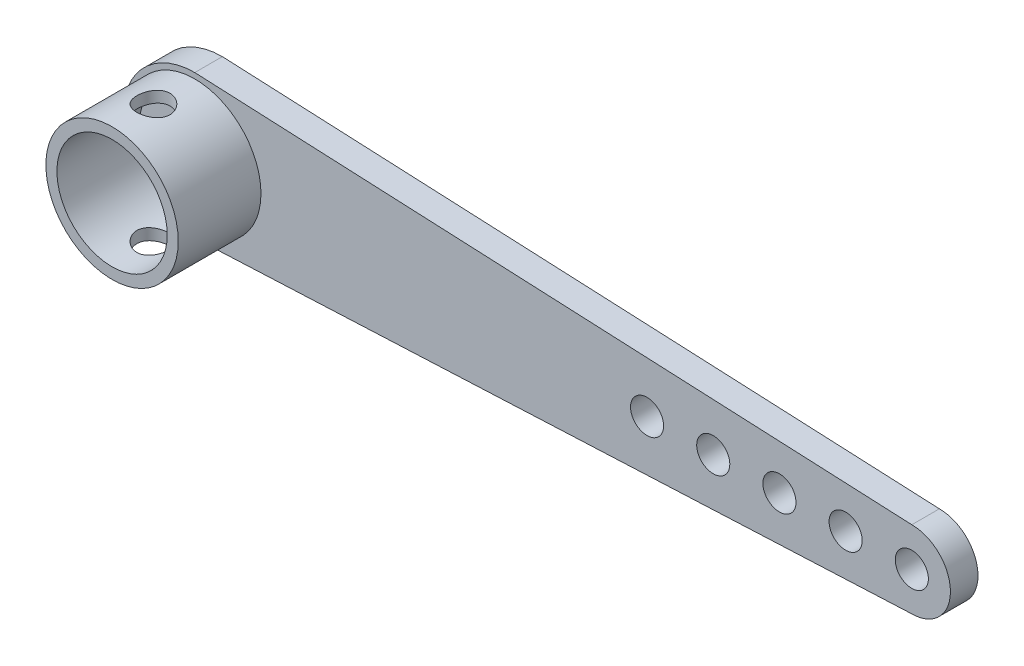
ISO-10303-21;
HEADER;
FILE_DESCRIPTION(('STEP AP214'),'2;1');
FILE_NAME('part.step','',(''),(''),'','','');
FILE_SCHEMA(('AUTOMOTIVE_DESIGN { 1 0 10303 214 1 1 1 1 }'));
ENDSEC;
DATA;
#1=APPLICATION_CONTEXT('core data for automotive mechanical design processes');
#2=APPLICATION_PROTOCOL_DEFINITION('international standard','automotive_design',2000,#1);
#3=PRODUCT_CONTEXT('',#1,'mechanical');
#4=PRODUCT('Part','Part','',(#3));
#5=PRODUCT_RELATED_PRODUCT_CATEGORY('part','',(#4));
#6=PRODUCT_DEFINITION_FORMATION('','',#4);
#7=PRODUCT_DEFINITION_CONTEXT('part definition',#1,'design');
#8=PRODUCT_DEFINITION('design','',#6,#7);
#9=PRODUCT_DEFINITION_SHAPE('','',#8);
#10=(LENGTH_UNIT() NAMED_UNIT(*) SI_UNIT(.MILLI.,.METRE.));
#11=(NAMED_UNIT(*) PLANE_ANGLE_UNIT() SI_UNIT($,.RADIAN.));
#12=(NAMED_UNIT(*) SI_UNIT($,.STERADIAN.) SOLID_ANGLE_UNIT());
#13=UNCERTAINTY_MEASURE_WITH_UNIT(LENGTH_MEASURE(1.E-05),#10,'distance_accuracy_value','');
#14=(GEOMETRIC_REPRESENTATION_CONTEXT(3) GLOBAL_UNCERTAINTY_ASSIGNED_CONTEXT((#13)) GLOBAL_UNIT_ASSIGNED_CONTEXT((#10,
#11,#12)) REPRESENTATION_CONTEXT('',''));
#15=CARTESIAN_POINT('',(0.,0.,0.));
#16=DIRECTION('',(0.,0.,1.));
#17=DIRECTION('',(1.,0.,0.));
#18=AXIS2_PLACEMENT_3D('',#15,#16,#17);
#19=CARTESIAN_POINT('',(0.598724610297591,-12.9723665564478,5.));
#20=DIRECTION('',(-0.0461047666084009,0.998936609848685,0.));
#21=DIRECTION('',(-0.998936609848685,-0.0461047666084009,0.));
#22=AXIS2_PLACEMENT_3D('',#19,#20,#21);
#23=PLANE('',#22);
#24=DIRECTION('',(0.998936609848685,0.0461047666084009,0.));
#25=VECTOR('',#24,1.);
#26=CARTESIAN_POINT('',(0.598724610297591,-12.9723665564478,0.));
#27=LINE('',#26,#25);
#28=CARTESIAN_POINT('',(0.,-13.,0.));
#29=VERTEX_POINT('',#28);
#30=CARTESIAN_POINT('',(130.,-7.,0.));
#31=VERTEX_POINT('',#30);
#32=EDGE_CURVE('E104',#29,#31,#27,.T.);
#33=ORIENTED_EDGE('',*,*,#32,.T.);
#34=DIRECTION('',(0.,0.,-1.));
#35=VECTOR('',#34,1.);
#36=CARTESIAN_POINT('',(130.,-7.,5.));
#37=LINE('',#36,#35);
#38=CARTESIAN_POINT('',(130.,-7.,5.));
#39=VERTEX_POINT('',#38);
#40=EDGE_CURVE('E11',#39,#31,#37,.T.);
#41=ORIENTED_EDGE('',*,*,#40,.F.);
#42=DIRECTION('',(0.998936609848685,0.0461047666084009,0.));
#43=VECTOR('',#42,1.);
#44=CARTESIAN_POINT('',(0.598724610297591,-12.9723665564478,5.));
#45=LINE('',#44,#43);
#46=CARTESIAN_POINT('',(0.,-13.,5.));
#47=VERTEX_POINT('',#46);
#48=EDGE_CURVE('E88',#47,#39,#45,.T.);
#49=ORIENTED_EDGE('',*,*,#48,.F.);
#50=DIRECTION('',(0.,0.,-1.));
#51=VECTOR('',#50,1.);
#52=CARTESIAN_POINT('',(0.,-13.,5.));
#53=LINE('',#52,#51);
#54=EDGE_CURVE('E100',#47,#29,#53,.T.);
#55=ORIENTED_EDGE('',*,*,#54,.T.);
#56=EDGE_LOOP('',(#33,#41,#49,#55));
#57=FACE_BOUND('',#56,.T.);
#58=ADVANCED_FACE('F39',(#57),#23,.F.);
#59=CARTESIAN_POINT('',(130.,0.,5.));
#60=DIRECTION('',(0.,0.,-1.));
#61=DIRECTION('',(-1.,0.,0.));
#62=AXIS2_PLACEMENT_3D('',#59,#60,#61);
#63=CYLINDRICAL_SURFACE('',#62,7.00000000000001);
#64=CARTESIAN_POINT('',(130.,0.,0.));
#65=DIRECTION('',(0.,0.,1.));
#66=DIRECTION('',(1.,0.,0.));
#67=AXIS2_PLACEMENT_3D('',#64,#65,#66);
#68=CIRCLE('',#67,7.00000000000001);
#69=CARTESIAN_POINT('',(130.,7.00000000000001,0.));
#70=VERTEX_POINT('',#69);
#71=EDGE_CURVE('E93',#31,#70,#68,.T.);
#72=ORIENTED_EDGE('',*,*,#71,.T.);
#73=DIRECTION('',(0.,0.,-1.));
#74=VECTOR('',#73,1.);
#75=CARTESIAN_POINT('',(130.,7.00000000000001,5.));
#76=LINE('',#75,#74);
#77=CARTESIAN_POINT('',(130.,7.00000000000001,5.));
#78=VERTEX_POINT('',#77);
#79=EDGE_CURVE('E48',#78,#70,#76,.T.);
#80=ORIENTED_EDGE('',*,*,#79,.F.);
#81=CARTESIAN_POINT('',(130.,0.,5.));
#82=DIRECTION('',(0.,0.,1.));
#83=DIRECTION('',(1.,0.,0.));
#84=AXIS2_PLACEMENT_3D('',#81,#82,#83);
#85=CIRCLE('',#84,7.00000000000001);
#86=EDGE_CURVE('E83',#39,#78,#85,.T.);
#87=ORIENTED_EDGE('',*,*,#86,.F.);
#88=ORIENTED_EDGE('',*,*,#40,.T.);
#89=EDGE_LOOP('',(#72,#80,#87,#88));
#90=FACE_BOUND('',#89,.T.);
#91=ADVANCED_FACE('F92',(#90),#63,.T.);
#92=CARTESIAN_POINT('',(0.598724610297591,12.9723665564478,5.));
#93=DIRECTION('',(0.0461047666084009,0.998936609848685,0.));
#94=DIRECTION('',(-0.998936609848685,0.0461047666084009,0.));
#95=AXIS2_PLACEMENT_3D('',#92,#93,#94);
#96=PLANE('',#95);
#97=DIRECTION('',(0.998936609848685,-0.0461047666084009,0.));
#98=VECTOR('',#97,1.);
#99=CARTESIAN_POINT('',(0.598724610297591,12.9723665564478,0.));
#100=LINE('',#99,#98);
#101=CARTESIAN_POINT('',(0.,13.,0.));
#102=VERTEX_POINT('',#101);
#103=EDGE_CURVE('E109',#102,#70,#100,.T.);
#104=ORIENTED_EDGE('',*,*,#103,.F.);
#105=DIRECTION('',(0.,0.,-1.));
#106=VECTOR('',#105,1.);
#107=CARTESIAN_POINT('',(0.,13.,5.));
#108=LINE('',#107,#106);
#109=CARTESIAN_POINT('',(0.,13.,5.));
#110=VERTEX_POINT('',#109);
#111=EDGE_CURVE('E73',#110,#102,#108,.T.);
#112=ORIENTED_EDGE('',*,*,#111,.F.);
#113=DIRECTION('',(0.998936609848685,-0.0461047666084009,0.));
#114=VECTOR('',#113,1.);
#115=CARTESIAN_POINT('',(0.598724610297591,12.9723665564478,5.));
#116=LINE('',#115,#114);
#117=EDGE_CURVE('E86',#110,#78,#116,.T.);
#118=ORIENTED_EDGE('',*,*,#117,.T.);
#119=ORIENTED_EDGE('',*,*,#79,.T.);
#120=EDGE_LOOP('',(#104,#112,#118,#119));
#121=FACE_BOUND('',#120,.T.);
#122=ADVANCED_FACE('F98',(#121),#96,.T.);
#123=CARTESIAN_POINT('',(0.,0.,5.));
#124=DIRECTION('',(0.,0.,-1.));
#125=DIRECTION('',(-1.,0.,0.));
#126=AXIS2_PLACEMENT_3D('',#123,#124,#125);
#127=CYLINDRICAL_SURFACE('',#126,13.);
#128=CARTESIAN_POINT('',(0.,0.,0.));
#129=DIRECTION('',(0.,0.,1.));
#130=DIRECTION('',(1.,0.,0.));
#131=AXIS2_PLACEMENT_3D('',#128,#129,#130);
#132=CIRCLE('',#131,13.);
#133=EDGE_CURVE('E76',#102,#29,#132,.T.);
#134=ORIENTED_EDGE('',*,*,#133,.T.);
#135=ORIENTED_EDGE('',*,*,#54,.F.);
#136=CARTESIAN_POINT('',(0.,0.,5.));
#137=DIRECTION('',(0.,0.,1.));
#138=DIRECTION('',(1.,0.,0.));
#139=AXIS2_PLACEMENT_3D('',#136,#137,#138);
#140=CIRCLE('',#139,13.);
#141=EDGE_CURVE('E57',#110,#47,#140,.T.);
#142=ORIENTED_EDGE('',*,*,#141,.F.);
#143=ORIENTED_EDGE('',*,*,#111,.T.);
#144=EDGE_LOOP('',(#134,#135,#142,#143));
#145=FACE_BOUND('',#144,.T.);
#146=ADVANCED_FACE('F169',(#145),#127,.T.);
#147=CARTESIAN_POINT('',(0.,0.,5.));
#148=DIRECTION('',(0.,0.,1.));
#149=DIRECTION('',(1.,0.,0.));
#150=AXIS2_PLACEMENT_3D('',#147,#148,#149);
#151=PLANE('',#150);
#152=CARTESIAN_POINT('',(130.,0.,5.));
#153=DIRECTION('',(0.,0.,1.));
#154=DIRECTION('',(1.,0.,0.));
#155=AXIS2_PLACEMENT_3D('',#152,#153,#154);
#156=CIRCLE('',#155,2.99999999999999);
#157=CARTESIAN_POINT('',(133.,0.,5.));
#158=VERTEX_POINT('',#157);
#159=EDGE_CURVE('E344',#158,#158,#156,.T.);
#160=ORIENTED_EDGE('',*,*,#159,.F.);
#161=EDGE_LOOP('',(#160));
#162=FACE_BOUND('',#161,.T.);
#163=CARTESIAN_POINT('',(118.,0.,5.));
#164=DIRECTION('',(0.,0.,1.));
#165=DIRECTION('',(1.,0.,0.));
#166=AXIS2_PLACEMENT_3D('',#163,#164,#165);
#167=CIRCLE('',#166,3.00000000000001);
#168=CARTESIAN_POINT('',(121.,0.,5.));
#169=VERTEX_POINT('',#168);
#170=EDGE_CURVE('E361',#169,#169,#167,.T.);
#171=ORIENTED_EDGE('',*,*,#170,.F.);
#172=EDGE_LOOP('',(#171));
#173=FACE_BOUND('',#172,.T.);
#174=CARTESIAN_POINT('',(106.,0.,5.));
#175=DIRECTION('',(0.,0.,1.));
#176=DIRECTION('',(1.,0.,0.));
#177=AXIS2_PLACEMENT_3D('',#174,#175,#176);
#178=CIRCLE('',#177,3.00000000000001);
#179=CARTESIAN_POINT('',(109.,0.,5.));
#180=VERTEX_POINT('',#179);
#181=EDGE_CURVE('E364',#180,#180,#178,.T.);
#182=ORIENTED_EDGE('',*,*,#181,.F.);
#183=EDGE_LOOP('',(#182));
#184=FACE_BOUND('',#183,.T.);
#185=CARTESIAN_POINT('',(94.,0.,5.));
#186=DIRECTION('',(0.,0.,1.));
#187=DIRECTION('',(1.,0.,0.));
#188=AXIS2_PLACEMENT_3D('',#185,#186,#187);
#189=CIRCLE('',#188,3.00000000000001);
#190=CARTESIAN_POINT('',(97.,0.,5.));
#191=VERTEX_POINT('',#190);
#192=EDGE_CURVE('E368',#191,#191,#189,.T.);
#193=ORIENTED_EDGE('',*,*,#192,.F.);
#194=EDGE_LOOP('',(#193));
#195=FACE_BOUND('',#194,.T.);
#196=CARTESIAN_POINT('',(82.,0.,5.));
#197=DIRECTION('',(0.,0.,1.));
#198=DIRECTION('',(1.,0.,0.));
#199=AXIS2_PLACEMENT_3D('',#196,#197,#198);
#200=CIRCLE('',#199,3.00000000000001);
#201=CARTESIAN_POINT('',(85.,0.,5.));
#202=VERTEX_POINT('',#201);
#203=EDGE_CURVE('E153',#202,#202,#200,.T.);
#204=ORIENTED_EDGE('',*,*,#203,.F.);
#205=EDGE_LOOP('',(#204));
#206=FACE_BOUND('',#205,.T.);
#207=CARTESIAN_POINT('',(0.,0.,5.));
#208=DIRECTION('',(0.,0.,1.));
#209=DIRECTION('',(1.,0.,0.));
#210=AXIS2_PLACEMENT_3D('',#207,#208,#209);
#211=CIRCLE('',#210,12.);
#212=CARTESIAN_POINT('',(12.,0.,5.));
#213=VERTEX_POINT('',#212);
#214=EDGE_CURVE('E187',#213,#213,#211,.T.);
#215=ORIENTED_EDGE('',*,*,#214,.F.);
#216=EDGE_LOOP('',(#215));
#217=FACE_BOUND('',#216,.T.);
#218=ORIENTED_EDGE('',*,*,#48,.T.);
#219=ORIENTED_EDGE('',*,*,#86,.T.);
#220=ORIENTED_EDGE('',*,*,#117,.F.);
#221=ORIENTED_EDGE('',*,*,#141,.T.);
#222=EDGE_LOOP('',(#218,#219,#220,#221));
#223=FACE_BOUND('',#222,.T.);
#224=ADVANCED_FACE('F84',(#162,#173,#184,#195,#206,#217,#223),#151,.T.);
#225=CARTESIAN_POINT('',(0.,0.,0.));
#226=DIRECTION('',(0.,0.,1.));
#227=DIRECTION('',(1.,0.,0.));
#228=AXIS2_PLACEMENT_3D('',#225,#226,#227);
#229=PLANE('',#228);
#230=CARTESIAN_POINT('',(130.,0.,0.));
#231=DIRECTION('',(0.,0.,1.));
#232=DIRECTION('',(1.,0.,0.));
#233=AXIS2_PLACEMENT_3D('',#230,#231,#232);
#234=CIRCLE('',#233,2.99999999999999);
#235=CARTESIAN_POINT('',(133.,0.,0.));
#236=VERTEX_POINT('',#235);
#237=EDGE_CURVE('E42',#236,#236,#234,.T.);
#238=ORIENTED_EDGE('',*,*,#237,.T.);
#239=EDGE_LOOP('',(#238));
#240=FACE_BOUND('',#239,.T.);
#241=CARTESIAN_POINT('',(118.,0.,0.));
#242=DIRECTION('',(0.,0.,1.));
#243=DIRECTION('',(1.,0.,0.));
#244=AXIS2_PLACEMENT_3D('',#241,#242,#243);
#245=CIRCLE('',#244,3.00000000000001);
#246=CARTESIAN_POINT('',(121.,0.,0.));
#247=VERTEX_POINT('',#246);
#248=EDGE_CURVE('E347',#247,#247,#245,.T.);
#249=ORIENTED_EDGE('',*,*,#248,.T.);
#250=EDGE_LOOP('',(#249));
#251=FACE_BOUND('',#250,.T.);
#252=CARTESIAN_POINT('',(106.,0.,0.));
#253=DIRECTION('',(0.,0.,1.));
#254=DIRECTION('',(1.,0.,0.));
#255=AXIS2_PLACEMENT_3D('',#252,#253,#254);
#256=CIRCLE('',#255,3.00000000000001);
#257=CARTESIAN_POINT('',(109.,0.,0.));
#258=VERTEX_POINT('',#257);
#259=EDGE_CURVE('E349',#258,#258,#256,.T.);
#260=ORIENTED_EDGE('',*,*,#259,.T.);
#261=EDGE_LOOP('',(#260));
#262=FACE_BOUND('',#261,.T.);
#263=CARTESIAN_POINT('',(94.,0.,0.));
#264=DIRECTION('',(0.,0.,1.));
#265=DIRECTION('',(1.,0.,0.));
#266=AXIS2_PLACEMENT_3D('',#263,#264,#265);
#267=CIRCLE('',#266,3.00000000000001);
#268=CARTESIAN_POINT('',(97.,0.,0.));
#269=VERTEX_POINT('',#268);
#270=EDGE_CURVE('E353',#269,#269,#267,.T.);
#271=ORIENTED_EDGE('',*,*,#270,.T.);
#272=EDGE_LOOP('',(#271));
#273=FACE_BOUND('',#272,.T.);
#274=CARTESIAN_POINT('',(82.,0.,0.));
#275=DIRECTION('',(0.,0.,1.));
#276=DIRECTION('',(1.,0.,0.));
#277=AXIS2_PLACEMENT_3D('',#274,#275,#276);
#278=CIRCLE('',#277,3.00000000000001);
#279=CARTESIAN_POINT('',(85.,0.,0.));
#280=VERTEX_POINT('',#279);
#281=EDGE_CURVE('E357',#280,#280,#278,.T.);
#282=ORIENTED_EDGE('',*,*,#281,.T.);
#283=EDGE_LOOP('',(#282));
#284=FACE_BOUND('',#283,.T.);
#285=ORIENTED_EDGE('',*,*,#32,.F.);
#286=ORIENTED_EDGE('',*,*,#133,.F.);
#287=ORIENTED_EDGE('',*,*,#103,.T.);
#288=ORIENTED_EDGE('',*,*,#71,.F.);
#289=EDGE_LOOP('',(#285,#286,#287,#288));
#290=FACE_BOUND('',#289,.T.);
#291=ADVANCED_FACE('F164',(#240,#251,#262,#273,#284,#290),#229,.F.);
#292=CARTESIAN_POINT('',(0.,0.,20.));
#293=DIRECTION('',(0.,0.,-1.));
#294=DIRECTION('',(-1.,0.,0.));
#295=AXIS2_PLACEMENT_3D('',#292,#293,#294);
#296=CYLINDRICAL_SURFACE('',#295,12.);
#297=CARTESIAN_POINT('',(0.,-12.,15.5));
#298=CARTESIAN_POINT('',(0.165752177339462,-11.9999971973602,15.4999953485237));
#299=CARTESIAN_POINT('',(0.331556315661526,-11.9965315626365,15.4862168984524));
#300=CARTESIAN_POINT('',(0.658412647541065,-11.9830422765979,15.431549697386));
#301=CARTESIAN_POINT('',(0.819462093741479,-11.9730149083995,15.3906455809243));
#302=CARTESIAN_POINT('',(1.13204174436515,-11.9475125266406,15.2831214930758));
#303=CARTESIAN_POINT('',(1.28358312686,-11.9320440568412,15.2165324025695));
#304=CARTESIAN_POINT('',(1.57334426380886,-11.8973068761524,15.0596372199103));
#305=CARTESIAN_POINT('',(1.71156356869753,-11.8780380370831,14.9693303277621));
#306=CARTESIAN_POINT('',(1.97360385460183,-11.8373482718339,14.7655984206916));
#307=CARTESIAN_POINT('',(2.09711138012211,-11.8158941429625,14.6517768500819));
#308=CARTESIAN_POINT('',(2.32349785440664,-11.7734724023587,14.4050955901819));
#309=CARTESIAN_POINT('',(2.42637447389838,-11.7525048457974,14.2722337541061));
#310=CARTESIAN_POINT('',(2.61005308559795,-11.7130955139634,13.988809546526));
#311=CARTESIAN_POINT('',(2.69050443185028,-11.6946958892962,13.8380135383825));
#312=CARTESIAN_POINT('',(2.82479381710149,-11.6629898963603,13.5245031766799));
#313=CARTESIAN_POINT('',(2.87863611088028,-11.6496827138884,13.361790733336));
#314=CARTESIAN_POINT('',(2.95710967360953,-11.6300095339265,13.0325130035967));
#315=CARTESIAN_POINT('',(2.98230453666411,-11.6235098199402,12.866090207924));
#316=CARTESIAN_POINT('',(3.00452355013282,-11.6177872491918,12.5312628620013));
#317=CARTESIAN_POINT('',(3.00155228363622,-11.6185632085586,12.3628586386157));
#318=CARTESIAN_POINT('',(2.96797304927941,-11.6271841103363,12.0331683845093));
#319=CARTESIAN_POINT('',(2.93803668038127,-11.6348572601459,11.8718087570693));
#320=CARTESIAN_POINT('',(2.85244837380599,-11.6561341934214,11.5564778981779));
#321=CARTESIAN_POINT('',(2.79679460413879,-11.6697383993848,11.4025071939422));
#322=CARTESIAN_POINT('',(2.66077895587437,-11.7015022781132,11.1045239674957));
#323=CARTESIAN_POINT('',(2.58017333446584,-11.7197065493963,10.9606276564209));
#324=CARTESIAN_POINT('',(2.39671255202989,-11.7585942169198,10.6881625804864));
#325=CARTESIAN_POINT('',(2.29385349761767,-11.7792780466926,10.5595965038655));
#326=CARTESIAN_POINT('',(2.06532684936244,-11.8215176107978,10.3175927686112));
#327=CARTESIAN_POINT('',(1.93909251633172,-11.84308138956,10.2046910198773));
#328=CARTESIAN_POINT('',(1.6692238350074,-11.8841193115751,10.0015575150722));
#329=CARTESIAN_POINT('',(1.52558895541589,-11.9035933909882,9.91132645147287));
#330=CARTESIAN_POINT('',(1.22423177736278,-11.9383546418838,9.75589882755123));
#331=CARTESIAN_POINT('',(1.06646278641725,-11.9536272025545,9.69078931949114));
#332=CARTESIAN_POINT('',(0.741752016285765,-11.9781583398283,9.58816538858085));
#333=CARTESIAN_POINT('',(0.574811998300968,-11.9874180667856,9.55064568716372));
#334=CARTESIAN_POINT('',(0.241079940780053,-11.9987099854275,9.50508486888232));
#335=CARTESIAN_POINT('',(0.0743934399764201,-12.0009210701655,9.4963139478494));
#336=CARTESIAN_POINT('',(-0.258065749603017,-11.998376096289,9.50649800411098));
#337=CARTESIAN_POINT('',(-0.423838519289193,-11.9936206648371,9.52545048559827));
#338=CARTESIAN_POINT('',(-0.747228537552981,-11.977791622547,9.58994181678275));
#339=CARTESIAN_POINT('',(-0.9049302379375,-11.9668126837158,9.63508252695395));
#340=CARTESIAN_POINT('',(-1.21051458490503,-11.9397741326831,9.75021416805692));
#341=CARTESIAN_POINT('',(-1.3583962380653,-11.9237140073996,9.82020760862644));
#342=CARTESIAN_POINT('',(-1.64304626885966,-11.8878661585244,9.98447225774935));
#343=CARTESIAN_POINT('',(-1.77957088367153,-11.868017347332,10.0791522247931));
#344=CARTESIAN_POINT('',(-2.03505322728662,-11.826890183755,10.2895798175943));
#345=CARTESIAN_POINT('',(-2.1540079179465,-11.8056115850589,10.4053310792353));
#346=CARTESIAN_POINT('',(-2.37398113614497,-11.76337913919,10.6580039216874));
#347=CARTESIAN_POINT('',(-2.47448773524221,-11.7424460836496,10.7953754059991));
#348=CARTESIAN_POINT('',(-2.65102151802725,-11.7038575676408,11.0854652689372));
#349=CARTESIAN_POINT('',(-2.72704978832281,-11.6862019616993,11.2381829659409));
#350=CARTESIAN_POINT('',(-2.85190284121468,-11.656361894336,11.5538114448125));
#351=CARTESIAN_POINT('',(-2.90088879328717,-11.6441451045097,11.7166552566246));
#352=CARTESIAN_POINT('',(-2.97069131988587,-11.626534880479,12.0486192757106));
#353=CARTESIAN_POINT('',(-2.99151405495183,-11.6211399540485,12.2177381020429));
#354=CARTESIAN_POINT('',(-3.004077180673,-11.6178980244194,12.5522420477232));
#355=CARTESIAN_POINT('',(-2.99663579556158,-11.6198386546564,12.7175948702529));
#356=CARTESIAN_POINT('',(-2.95475455662439,-11.6305581800657,13.0446077773325));
#357=CARTESIAN_POINT('',(-2.92031524537318,-11.6393369378128,13.2062679360264));
#358=CARTESIAN_POINT('',(-2.82586263888595,-11.6626252136787,13.5204169181317));
#359=CARTESIAN_POINT('',(-2.76600280936085,-11.6771003047327,13.6729546104807));
#360=CARTESIAN_POINT('',(-2.62252982721005,-11.7101551144901,13.9659307654271));
#361=CARTESIAN_POINT('',(-2.53891338006835,-11.7287354024137,14.1063675463738));
#362=CARTESIAN_POINT('',(-2.3477354972743,-11.7685126852721,14.3751092580041));
#363=CARTESIAN_POINT('',(-2.23960632582452,-11.7897652966356,14.5030021468479));
#364=CARTESIAN_POINT('',(-2.00357874237946,-11.8321605449252,14.7390940895908));
#365=CARTESIAN_POINT('',(-1.87567564252229,-11.8533031545411,14.8472884602259));
#366=CARTESIAN_POINT('',(-1.60093517340518,-11.8935531129534,15.0428226171292));
#367=CARTESIAN_POINT('',(-1.45379684463277,-11.9126166673174,15.1297492273432));
#368=CARTESIAN_POINT('',(-1.14653211902095,-11.9460984995023,15.2774949258811));
#369=CARTESIAN_POINT('',(-0.986415126873479,-11.9605201039956,15.3383327212971));
#370=CARTESIAN_POINT('',(-0.688820506486943,-11.9809611913108,15.4231436606593));
#371=CARTESIAN_POINT('',(-0.552760341816137,-11.9880517010538,15.4519024861069));
#372=CARTESIAN_POINT('',(-0.277812143072566,-11.997572104639,15.4903318872439));
#373=CARTESIAN_POINT('',(-0.138924322485232,-12.0000023490179,15.5000038986106));
#374=CARTESIAN_POINT('',(0.,-12.,15.5));
#375=B_SPLINE_CURVE_WITH_KNOTS('',3,(#297,#298,#299,#300,#301,#302,#303,#304,#305,#306,#307,
#308,#309,#310,#311,#312,#313,#314,#315,#316,#317,#318,#319,#320,#321,#322,#323,#324,#325,#326,
#327,#328,#329,#330,#331,#332,#333,#334,#335,#336,#337,#338,#339,#340,#341,#342,#343,#344,#345,
#346,#347,#348,#349,#350,#351,#352,#353,#354,#355,#356,#357,#358,#359,#360,#361,#362,#363,#364,
#365,#366,#367,#368,#369,#370,#371,#372,#373,#374),.UNSPECIFIED.,.T.,.F.,(4,2,2,2,2,2,2,2,2,2,2,
2,2,2,2,2,2,2,2,2,2,2,2,2,2,2,2,2,2,2,2,2,2,2,2,2,2,2,4),(0.,0.496747424943779,0.9937764755278,
1.49020980457221,1.98665988033866,2.49228870874278,2.99797459160124,3.51117295091613,
4.02428922338737,4.5271259020214,5.02988076232035,5.52044994020678,6.01105406938718,
6.506610557544,7.00225381678967,7.5120300194468,8.02182179123136,8.5333645802487,
9.04480947383927,9.54316617905194,10.0414780223213,10.5324054903472,11.0233825465122,
11.5230717513735,12.0228472602268,12.5348901841559,13.0469103750566,13.5558450923716,
14.0646684651657,14.5588756080898,15.0530728192382,15.5443280113065,16.0356513628556,
16.5397915283158,17.0440513955259,17.5574437101093,18.0704672765446,18.4868448589605,
18.9031911209784),.UNSPECIFIED.);
#376=CARTESIAN_POINT('',(0.,-12.,15.5));
#377=VERTEX_POINT('',#376);
#378=EDGE_CURVE('E152',#377,#377,#375,.T.);
#379=ORIENTED_EDGE('',*,*,#378,.T.);
#380=EDGE_LOOP('',(#379));
#381=FACE_BOUND('',#380,.T.);
#382=CARTESIAN_POINT('',(0.,12.,15.5));
#383=CARTESIAN_POINT('',(-0.165752177339462,11.9999971973602,15.4999953485237));
#384=CARTESIAN_POINT('',(-0.331556315661526,11.9965315626365,15.4862168984524));
#385=CARTESIAN_POINT('',(-0.658412647541065,11.9830422765979,15.431549697386));
#386=CARTESIAN_POINT('',(-0.819462093741479,11.9730149083995,15.3906455809243));
#387=CARTESIAN_POINT('',(-1.13204174436515,11.9475125266406,15.2831214930758));
#388=CARTESIAN_POINT('',(-1.28358312686,11.9320440568412,15.2165324025695));
#389=CARTESIAN_POINT('',(-1.57334426380886,11.8973068761524,15.0596372199103));
#390=CARTESIAN_POINT('',(-1.71156356869753,11.8780380370831,14.9693303277621));
#391=CARTESIAN_POINT('',(-1.97360385460183,11.8373482718339,14.7655984206916));
#392=CARTESIAN_POINT('',(-2.09711138012211,11.8158941429625,14.6517768500819));
#393=CARTESIAN_POINT('',(-2.32349785440664,11.7734724023587,14.4050955901819));
#394=CARTESIAN_POINT('',(-2.42637447389838,11.7525048457974,14.2722337541061));
#395=CARTESIAN_POINT('',(-2.61005308559795,11.7130955139634,13.988809546526));
#396=CARTESIAN_POINT('',(-2.69050443185028,11.6946958892962,13.8380135383825));
#397=CARTESIAN_POINT('',(-2.82479381710149,11.6629898963603,13.5245031766799));
#398=CARTESIAN_POINT('',(-2.87863611088028,11.6496827138884,13.361790733336));
#399=CARTESIAN_POINT('',(-2.95710967360953,11.6300095339265,13.0325130035967));
#400=CARTESIAN_POINT('',(-2.98230453666411,11.6235098199402,12.866090207924));
#401=CARTESIAN_POINT('',(-3.00452355013282,11.6177872491918,12.5312628620013));
#402=CARTESIAN_POINT('',(-3.00155228363622,11.6185632085586,12.3628586386157));
#403=CARTESIAN_POINT('',(-2.96797304927941,11.6271841103363,12.0331683845093));
#404=CARTESIAN_POINT('',(-2.93803668038127,11.6348572601459,11.8718087570693));
#405=CARTESIAN_POINT('',(-2.85244837380599,11.6561341934214,11.5564778981779));
#406=CARTESIAN_POINT('',(-2.79679460413879,11.6697383993848,11.4025071939422));
#407=CARTESIAN_POINT('',(-2.66077895587437,11.7015022781132,11.1045239674957));
#408=CARTESIAN_POINT('',(-2.58017333446584,11.7197065493963,10.9606276564209));
#409=CARTESIAN_POINT('',(-2.39671255202989,11.7585942169198,10.6881625804864));
#410=CARTESIAN_POINT('',(-2.29385349761767,11.7792780466926,10.5595965038655));
#411=CARTESIAN_POINT('',(-2.06532684936244,11.8215176107978,10.3175927686112));
#412=CARTESIAN_POINT('',(-1.93909251633172,11.84308138956,10.2046910198773));
#413=CARTESIAN_POINT('',(-1.6692238350074,11.8841193115751,10.0015575150722));
#414=CARTESIAN_POINT('',(-1.52558895541589,11.9035933909882,9.91132645147287));
#415=CARTESIAN_POINT('',(-1.22423177736278,11.9383546418838,9.75589882755123));
#416=CARTESIAN_POINT('',(-1.06646278641725,11.9536272025545,9.69078931949114));
#417=CARTESIAN_POINT('',(-0.741752016285765,11.9781583398283,9.58816538858085));
#418=CARTESIAN_POINT('',(-0.574811998300968,11.9874180667856,9.55064568716372));
#419=CARTESIAN_POINT('',(-0.241079940780053,11.9987099854275,9.50508486888232));
#420=CARTESIAN_POINT('',(-0.0743934399764201,12.0009210701655,9.4963139478494));
#421=CARTESIAN_POINT('',(0.258065749603017,11.998376096289,9.50649800411098));
#422=CARTESIAN_POINT('',(0.423838519289193,11.9936206648371,9.52545048559827));
#423=CARTESIAN_POINT('',(0.747228537552981,11.977791622547,9.58994181678275));
#424=CARTESIAN_POINT('',(0.9049302379375,11.9668126837158,9.63508252695395));
#425=CARTESIAN_POINT('',(1.21051458490503,11.9397741326831,9.75021416805692));
#426=CARTESIAN_POINT('',(1.3583962380653,11.9237140073996,9.82020760862644));
#427=CARTESIAN_POINT('',(1.64304626885966,11.8878661585244,9.98447225774935));
#428=CARTESIAN_POINT('',(1.77957088367153,11.868017347332,10.0791522247931));
#429=CARTESIAN_POINT('',(2.03505322728662,11.826890183755,10.2895798175943));
#430=CARTESIAN_POINT('',(2.1540079179465,11.8056115850589,10.4053310792353));
#431=CARTESIAN_POINT('',(2.37398113614497,11.76337913919,10.6580039216874));
#432=CARTESIAN_POINT('',(2.47448773524221,11.7424460836496,10.7953754059991));
#433=CARTESIAN_POINT('',(2.65102151802725,11.7038575676408,11.0854652689372));
#434=CARTESIAN_POINT('',(2.72704978832281,11.6862019616993,11.2381829659409));
#435=CARTESIAN_POINT('',(2.85190284121468,11.656361894336,11.5538114448125));
#436=CARTESIAN_POINT('',(2.90088879328717,11.6441451045097,11.7166552566246));
#437=CARTESIAN_POINT('',(2.97069131988587,11.626534880479,12.0486192757106));
#438=CARTESIAN_POINT('',(2.99151405495183,11.6211399540485,12.2177381020429));
#439=CARTESIAN_POINT('',(3.004077180673,11.6178980244194,12.5522420477232));
#440=CARTESIAN_POINT('',(2.99663579556158,11.6198386546564,12.7175948702529));
#441=CARTESIAN_POINT('',(2.95475455662439,11.6305581800657,13.0446077773325));
#442=CARTESIAN_POINT('',(2.92031524537318,11.6393369378128,13.2062679360264));
#443=CARTESIAN_POINT('',(2.82586263888595,11.6626252136787,13.5204169181317));
#444=CARTESIAN_POINT('',(2.76600280936085,11.6771003047327,13.6729546104807));
#445=CARTESIAN_POINT('',(2.62252982721005,11.7101551144901,13.9659307654271));
#446=CARTESIAN_POINT('',(2.53891338006835,11.7287354024137,14.1063675463738));
#447=CARTESIAN_POINT('',(2.3477354972743,11.7685126852721,14.3751092580041));
#448=CARTESIAN_POINT('',(2.23960632582452,11.7897652966356,14.5030021468479));
#449=CARTESIAN_POINT('',(2.00357874237946,11.8321605449252,14.7390940895908));
#450=CARTESIAN_POINT('',(1.87567564252229,11.8533031545411,14.8472884602259));
#451=CARTESIAN_POINT('',(1.60093517340518,11.8935531129534,15.0428226171292));
#452=CARTESIAN_POINT('',(1.45379684463277,11.9126166673174,15.1297492273432));
#453=CARTESIAN_POINT('',(1.14653211902095,11.9460984995023,15.2774949258811));
#454=CARTESIAN_POINT('',(0.986415126873479,11.9605201039956,15.3383327212971));
#455=CARTESIAN_POINT('',(0.688820506486943,11.9809611913108,15.4231436606593));
#456=CARTESIAN_POINT('',(0.552760341816137,11.9880517010538,15.4519024861069));
#457=CARTESIAN_POINT('',(0.277812143072566,11.997572104639,15.4903318872439));
#458=CARTESIAN_POINT('',(0.138924322485232,12.0000023490179,15.5000038986106));
#459=CARTESIAN_POINT('',(0.,12.,15.5));
#460=B_SPLINE_CURVE_WITH_KNOTS('',3,(#382,#383,#384,#385,#386,#387,#388,#389,#390,#391,#392,
#393,#394,#395,#396,#397,#398,#399,#400,#401,#402,#403,#404,#405,#406,#407,#408,#409,#410,#411,
#412,#413,#414,#415,#416,#417,#418,#419,#420,#421,#422,#423,#424,#425,#426,#427,#428,#429,#430,
#431,#432,#433,#434,#435,#436,#437,#438,#439,#440,#441,#442,#443,#444,#445,#446,#447,#448,#449,
#450,#451,#452,#453,#454,#455,#456,#457,#458,#459),.UNSPECIFIED.,.T.,.F.,(4,2,2,2,2,2,2,2,2,2,2,
2,2,2,2,2,2,2,2,2,2,2,2,2,2,2,2,2,2,2,2,2,2,2,2,2,2,2,4),(0.,0.496747424943779,0.9937764755278,
1.49020980457221,1.98665988033866,2.49228870874278,2.99797459160124,3.51117295091613,
4.02428922338737,4.5271259020214,5.02988076232035,5.52044994020678,6.01105406938718,
6.506610557544,7.00225381678967,7.5120300194468,8.02182179123136,8.5333645802487,
9.04480947383927,9.54316617905194,10.0414780223213,10.5324054903472,11.0233825465122,
11.5230717513735,12.0228472602268,12.5348901841559,13.0469103750566,13.5558450923716,
14.0646684651657,14.5588756080898,15.0530728192382,15.5443280113065,16.0356513628556,
16.5397915283158,17.0440513955259,17.5574437101093,18.0704672765446,18.4868448589605,
18.9031911209784),.UNSPECIFIED.);
#461=CARTESIAN_POINT('',(0.,12.,15.5));
#462=VERTEX_POINT('',#461);
#463=EDGE_CURVE('E145',#462,#462,#460,.T.);
#464=ORIENTED_EDGE('',*,*,#463,.T.);
#465=EDGE_LOOP('',(#464));
#466=FACE_BOUND('',#465,.T.);
#467=CARTESIAN_POINT('',(0.,0.,20.));
#468=DIRECTION('',(0.,0.,1.));
#469=DIRECTION('',(1.,0.,0.));
#470=AXIS2_PLACEMENT_3D('',#467,#468,#469);
#471=CIRCLE('',#470,12.);
#472=CARTESIAN_POINT('',(12.,0.,20.));
#473=VERTEX_POINT('',#472);
#474=EDGE_CURVE('E107',#473,#473,#471,.T.);
#475=ORIENTED_EDGE('',*,*,#474,.F.);
#476=EDGE_LOOP('',(#475));
#477=FACE_BOUND('',#476,.T.);
#478=ORIENTED_EDGE('',*,*,#214,.T.);
#479=EDGE_LOOP('',(#478));
#480=FACE_BOUND('',#479,.T.);
#481=ADVANCED_FACE('F159',(#381,#466,#477,#480),#296,.T.);
#482=CARTESIAN_POINT('',(0.,0.,20.));
#483=DIRECTION('',(0.,0.,1.));
#484=DIRECTION('',(1.,0.,0.));
#485=AXIS2_PLACEMENT_3D('',#482,#483,#484);
#486=PLANE('',#485);
#487=CARTESIAN_POINT('',(0.,0.,20.));
#488=DIRECTION('',(0.,0.,1.));
#489=DIRECTION('',(1.,0.,0.));
#490=AXIS2_PLACEMENT_3D('',#487,#488,#489);
#491=CIRCLE('',#490,10.);
#492=CARTESIAN_POINT('',(10.,0.,20.));
#493=VERTEX_POINT('',#492);
#494=EDGE_CURVE('E193',#493,#493,#491,.T.);
#495=ORIENTED_EDGE('',*,*,#494,.F.);
#496=EDGE_LOOP('',(#495));
#497=FACE_BOUND('',#496,.T.);
#498=ORIENTED_EDGE('',*,*,#474,.T.);
#499=EDGE_LOOP('',(#498));
#500=FACE_BOUND('',#499,.T.);
#501=ADVANCED_FACE('F163',(#497,#500),#486,.T.);
#502=CARTESIAN_POINT('',(0.,0.,5.));
#503=DIRECTION('',(0.,0.,1.));
#504=DIRECTION('',(1.,0.,0.));
#505=AXIS2_PLACEMENT_3D('',#502,#503,#504);
#506=CYLINDRICAL_SURFACE('',#505,10.);
#507=CARTESIAN_POINT('',(0.,-10.,15.5));
#508=CARTESIAN_POINT('',(-0.1645772255066,-9.99999858501101,15.4999980050302));
#509=CARTESIAN_POINT('',(-0.329174636703059,-9.99589831387907,15.4864122727521));
#510=CARTESIAN_POINT('',(-0.653576250609762,-9.97994211187382,15.4325572915558));
#511=CARTESIAN_POINT('',(-0.81337900882284,-9.96808386779384,15.3922800839533));
#512=CARTESIAN_POINT('',(-1.12346541550905,-9.93791105003673,15.2865079661795));
#513=CARTESIAN_POINT('',(-1.27376272879075,-9.91960600500851,15.2210502607621));
#514=CARTESIAN_POINT('',(-1.56124836210626,-9.87844218475291,15.0669278138883));
#515=CARTESIAN_POINT('',(-1.69843493493934,-9.85558280384133,14.9782599852092));
#516=CARTESIAN_POINT('',(-1.95974359436749,-9.80701474385548,14.7775519850547));
#517=CARTESIAN_POINT('',(-2.08343614248868,-9.78124767314073,14.6649667482282));
#518=CARTESIAN_POINT('',(-2.31049841846647,-9.73011668420884,14.4207815401796));
#519=CARTESIAN_POINT('',(-2.41386472654882,-9.70475283449003,14.2891783757501));
#520=CARTESIAN_POINT('',(-2.59960075447415,-9.65668227987544,14.0070584939248));
#521=CARTESIAN_POINT('',(-2.68144618044427,-9.63404813327749,13.8561830780185));
#522=CARTESIAN_POINT('',(-2.81842789549521,-9.59487240788062,13.5420214915394));
#523=CARTESIAN_POINT('',(-2.87357059839947,-9.57832936626621,13.378738312144));
#524=CARTESIAN_POINT('',(-2.95403267365303,-9.55381741676868,13.0492194677391));
#525=CARTESIAN_POINT('',(-2.98014392469355,-9.54562138649067,12.8831945122721));
#526=CARTESIAN_POINT('',(-3.00427461229344,-9.53805579499534,12.5489336875665));
#527=CARTESIAN_POINT('',(-3.00230085522157,-9.53868409521142,12.3806983638818));
#528=CARTESIAN_POINT('',(-2.97093954399623,-9.54849488135555,12.053232182783));
#529=CARTESIAN_POINT('',(-2.9425441052537,-9.55736777198281,11.8938954992755));
#530=CARTESIAN_POINT('',(-2.86074840854112,-9.58216712457248,11.5823604274531));
#531=CARTESIAN_POINT('',(-2.80734568283282,-9.59809428264701,11.4301627452513));
#532=CARTESIAN_POINT('',(-2.67632053307363,-9.63545466149946,11.1347993006785));
#533=CARTESIAN_POINT('',(-2.59837633869285,-9.65696032231904,10.9917858320895));
#534=CARTESIAN_POINT('',(-2.42070445177367,-9.70301974000129,10.7205359559796));
#535=CARTESIAN_POINT('',(-2.32097148005177,-9.72757423493982,10.5923031411724));
#536=CARTESIAN_POINT('',(-2.09762581531093,-9.77822022595875,10.348627618476));
#537=CARTESIAN_POINT('',(-1.97318981493394,-9.80433308620996,10.2339426719407));
#538=CARTESIAN_POINT('',(-1.70652651862793,-9.85424488126517,10.0268920318715));
#539=CARTESIAN_POINT('',(-1.56429810372178,-9.8780436703682,9.93452774317115));
#540=CARTESIAN_POINT('',(-1.26471007668561,-9.92086320138941,9.77428015507054));
#541=CARTESIAN_POINT('',(-1.1072554994959,-9.93985087336628,9.70656496750028));
#542=CARTESIAN_POINT('',(-0.782490831207039,-9.97067043664444,9.59880081980074));
#543=CARTESIAN_POINT('',(-0.615183503179163,-9.98250432373999,9.55874414293502));
#544=CARTESIAN_POINT('',(-0.281904485336663,-9.99736729287077,9.50869564420121));
#545=CARTESIAN_POINT('',(-0.116100195202374,-10.0006970083558,9.49767682839678));
#546=CARTESIAN_POINT('',(0.214999211646766,-9.99905846483519,9.50313831142416));
#547=CARTESIAN_POINT('',(0.380294393381561,-9.99409131355514,9.51961493930289));
#548=CARTESIAN_POINT('',(0.701807210619394,-9.97661393974325,9.57876922222299));
#549=CARTESIAN_POINT('',(0.858145545228339,-9.96427659598829,9.62084677516174));
#550=CARTESIAN_POINT('',(1.16150927790904,-9.9334869568307,9.7292864655564));
#551=CARTESIAN_POINT('',(1.30853355405117,-9.91503392642188,9.79565152207572));
#552=CARTESIAN_POINT('',(1.5928743789221,-9.87339308702631,9.95250633096227));
#553=CARTESIAN_POINT('',(1.72988765239933,-9.8501056165928,10.043518681896));
#554=CARTESIAN_POINT('',(1.9870466159603,-9.80146937528705,10.2464495081056));
#555=CARTESIAN_POINT('',(2.10718806471188,-9.7761200886242,10.3583732237753));
#556=CARTESIAN_POINT('',(2.33171489102052,-9.72506343738007,10.6047746167387));
#557=CARTESIAN_POINT('',(2.43536962463001,-9.69937650065513,10.7399237515437));
#558=CARTESIAN_POINT('',(2.61857990144313,-9.65153030477949,11.0262558780269));
#559=CARTESIAN_POINT('',(2.69813607658965,-9.62937095313121,11.1774384491158));
#560=CARTESIAN_POINT('',(2.83034694254316,-9.5913437922631,11.49106498251));
#561=CARTESIAN_POINT('',(2.88312693874022,-9.57544675673501,11.6534523730757));
#562=CARTESIAN_POINT('',(2.96043461630306,-9.55183188739737,11.9853759378605));
#563=CARTESIAN_POINT('',(2.98497197957849,-9.54411125069387,12.1549096415661));
#564=CARTESIAN_POINT('',(3.0044396896993,-9.53799944941558,12.4887230367768));
#565=CARTESIAN_POINT('',(3.00056110615887,-9.53923294700394,12.6529273020988));
#566=CARTESIAN_POINT('',(2.9661501088861,-9.54998802392188,12.9782282068012));
#567=CARTESIAN_POINT('',(2.93561876249408,-9.55950927135902,13.139324970361));
#568=CARTESIAN_POINT('',(2.84953777608686,-9.58551527389243,13.4518907982634));
#569=CARTESIAN_POINT('',(2.79430351014248,-9.60191209104934,13.6034545747174));
#570=CARTESIAN_POINT('',(2.66063014242147,-9.63980557805265,13.8952848776414));
#571=CARTESIAN_POINT('',(2.58218659925722,-9.6613032238508,14.0355492352832));
#572=CARTESIAN_POINT('',(2.40097527610175,-9.70795352855338,14.3063262330525));
#573=CARTESIAN_POINT('',(2.29742552185996,-9.7332108032858,14.4362975225204));
#574=CARTESIAN_POINT('',(2.07034869259555,-9.78402640899066,14.6774049966162));
#575=CARTESIAN_POINT('',(1.94681643426898,-9.80958481647543,14.7885362789356));
#576=CARTESIAN_POINT('',(1.67893152436652,-9.85901873141573,14.9920468245899));
#577=CARTESIAN_POINT('',(1.53407577158122,-9.88282319531421,15.0837828937109));
#578=CARTESIAN_POINT('',(1.23028274796705,-9.92521360911553,15.2414703398081));
#579=CARTESIAN_POINT('',(1.07135210599791,-9.94380199862114,15.307433776549));
#580=CARTESIAN_POINT('',(0.761515425310563,-9.97204349938619,15.4057905513055));
#581=CARTESIAN_POINT('',(0.611573923908468,-9.9824405476214,15.4410233457665));
#582=CARTESIAN_POINT('',(0.307760390461558,-9.9964188898898,15.4881270504832));
#583=CARTESIAN_POINT('',(0.153889019716279,-10.0000013230948,15.5000018654096));
#584=CARTESIAN_POINT('',(0.,-10.,15.5));
#585=B_SPLINE_CURVE_WITH_KNOTS('',3,(#507,#508,#509,#510,#511,#512,#513,#514,#515,#516,#517,
#518,#519,#520,#521,#522,#523,#524,#525,#526,#527,#528,#529,#530,#531,#532,#533,#534,#535,#536,
#537,#538,#539,#540,#541,#542,#543,#544,#545,#546,#547,#548,#549,#550,#551,#552,#553,#554,#555,
#556,#557,#558,#559,#560,#561,#562,#563,#564,#565,#566,#567,#568,#569,#570,#571,#572,#573,#574,
#575,#576,#577,#578,#579,#580,#581,#582,#583,#584),.UNSPECIFIED.,.T.,.F.,(4,2,2,2,2,2,2,2,2,2,2,
2,2,2,2,2,2,2,2,2,2,2,2,2,2,2,2,2,2,2,2,2,2,2,2,2,2,2,4),(0.,0.493166407225221,
0.986479929691999,1.47906735260175,1.9717203288254,2.47711205896383,2.98258874577266,
3.49942962008218,4.01614629086447,4.51839378713198,5.02051956638179,5.50452033395352,
5.98856887316003,6.47924852894239,6.97004720317111,7.48134208096333,7.99266913062143,
8.50742093763377,9.02202907057615,9.5181761887709,10.0142570710065,10.4991349336465,
10.9840710918746,11.4802261140582,11.9765056400038,12.4908080064564,13.0050968850536,
13.516956299025,14.0286401892057,14.5190031093854,15.0093463933232,15.4936008081456,
15.9779479511533,16.4799385136898,16.9820594980412,17.4988599232246,18.0154182319959,
18.4766338387004,18.9377723390687),.UNSPECIFIED.);
#586=CARTESIAN_POINT('',(0.,-10.,15.5));
#587=VERTEX_POINT('',#586);
#588=EDGE_CURVE('E122',#587,#587,#585,.T.);
#589=ORIENTED_EDGE('',*,*,#588,.T.);
#590=EDGE_LOOP('',(#589));
#591=FACE_BOUND('',#590,.T.);
#592=CARTESIAN_POINT('',(0.,10.,15.5));
#593=CARTESIAN_POINT('',(0.1645772255066,9.99999858501101,15.4999980050302));
#594=CARTESIAN_POINT('',(0.329174636703059,9.99589831387907,15.4864122727521));
#595=CARTESIAN_POINT('',(0.653576250609762,9.97994211187382,15.4325572915558));
#596=CARTESIAN_POINT('',(0.81337900882284,9.96808386779384,15.3922800839533));
#597=CARTESIAN_POINT('',(1.12346541550905,9.93791105003673,15.2865079661795));
#598=CARTESIAN_POINT('',(1.27376272879075,9.91960600500851,15.2210502607621));
#599=CARTESIAN_POINT('',(1.56124836210626,9.87844218475291,15.0669278138883));
#600=CARTESIAN_POINT('',(1.69843493493934,9.85558280384133,14.9782599852092));
#601=CARTESIAN_POINT('',(1.95974359436749,9.80701474385548,14.7775519850547));
#602=CARTESIAN_POINT('',(2.08343614248868,9.78124767314073,14.6649667482282));
#603=CARTESIAN_POINT('',(2.31049841846647,9.73011668420884,14.4207815401796));
#604=CARTESIAN_POINT('',(2.41386472654882,9.70475283449003,14.2891783757501));
#605=CARTESIAN_POINT('',(2.59960075447415,9.65668227987544,14.0070584939248));
#606=CARTESIAN_POINT('',(2.68144618044427,9.63404813327749,13.8561830780185));
#607=CARTESIAN_POINT('',(2.81842789549521,9.59487240788062,13.5420214915394));
#608=CARTESIAN_POINT('',(2.87357059839947,9.57832936626621,13.378738312144));
#609=CARTESIAN_POINT('',(2.95403267365303,9.55381741676868,13.0492194677391));
#610=CARTESIAN_POINT('',(2.98014392469355,9.54562138649067,12.8831945122721));
#611=CARTESIAN_POINT('',(3.00427461229344,9.53805579499534,12.5489336875665));
#612=CARTESIAN_POINT('',(3.00230085522157,9.53868409521142,12.3806983638818));
#613=CARTESIAN_POINT('',(2.97093954399623,9.54849488135555,12.053232182783));
#614=CARTESIAN_POINT('',(2.9425441052537,9.55736777198281,11.8938954992755));
#615=CARTESIAN_POINT('',(2.86074840854112,9.58216712457248,11.5823604274531));
#616=CARTESIAN_POINT('',(2.80734568283282,9.59809428264701,11.4301627452513));
#617=CARTESIAN_POINT('',(2.67632053307363,9.63545466149946,11.1347993006785));
#618=CARTESIAN_POINT('',(2.59837633869285,9.65696032231904,10.9917858320895));
#619=CARTESIAN_POINT('',(2.42070445177367,9.70301974000129,10.7205359559796));
#620=CARTESIAN_POINT('',(2.32097148005177,9.72757423493982,10.5923031411724));
#621=CARTESIAN_POINT('',(2.09762581531093,9.77822022595875,10.348627618476));
#622=CARTESIAN_POINT('',(1.97318981493394,9.80433308620996,10.2339426719407));
#623=CARTESIAN_POINT('',(1.70652651862793,9.85424488126517,10.0268920318715));
#624=CARTESIAN_POINT('',(1.56429810372178,9.8780436703682,9.93452774317115));
#625=CARTESIAN_POINT('',(1.26471007668561,9.92086320138941,9.77428015507054));
#626=CARTESIAN_POINT('',(1.1072554994959,9.93985087336628,9.70656496750028));
#627=CARTESIAN_POINT('',(0.782490831207039,9.97067043664444,9.59880081980074));
#628=CARTESIAN_POINT('',(0.615183503179163,9.98250432373999,9.55874414293502));
#629=CARTESIAN_POINT('',(0.281904485336663,9.99736729287077,9.50869564420121));
#630=CARTESIAN_POINT('',(0.116100195202374,10.0006970083558,9.49767682839678));
#631=CARTESIAN_POINT('',(-0.214999211646766,9.99905846483519,9.50313831142416));
#632=CARTESIAN_POINT('',(-0.380294393381561,9.99409131355514,9.51961493930289));
#633=CARTESIAN_POINT('',(-0.701807210619394,9.97661393974325,9.57876922222299));
#634=CARTESIAN_POINT('',(-0.858145545228339,9.96427659598829,9.62084677516174));
#635=CARTESIAN_POINT('',(-1.16150927790904,9.9334869568307,9.7292864655564));
#636=CARTESIAN_POINT('',(-1.30853355405117,9.91503392642188,9.79565152207572));
#637=CARTESIAN_POINT('',(-1.5928743789221,9.87339308702631,9.95250633096227));
#638=CARTESIAN_POINT('',(-1.72988765239933,9.8501056165928,10.043518681896));
#639=CARTESIAN_POINT('',(-1.9870466159603,9.80146937528705,10.2464495081056));
#640=CARTESIAN_POINT('',(-2.10718806471188,9.7761200886242,10.3583732237753));
#641=CARTESIAN_POINT('',(-2.33171489102052,9.72506343738007,10.6047746167387));
#642=CARTESIAN_POINT('',(-2.43536962463001,9.69937650065513,10.7399237515437));
#643=CARTESIAN_POINT('',(-2.61857990144313,9.65153030477949,11.0262558780269));
#644=CARTESIAN_POINT('',(-2.69813607658965,9.62937095313121,11.1774384491158));
#645=CARTESIAN_POINT('',(-2.83034694254316,9.5913437922631,11.49106498251));
#646=CARTESIAN_POINT('',(-2.88312693874022,9.57544675673501,11.6534523730757));
#647=CARTESIAN_POINT('',(-2.96043461630306,9.55183188739737,11.9853759378605));
#648=CARTESIAN_POINT('',(-2.98497197957849,9.54411125069387,12.1549096415661));
#649=CARTESIAN_POINT('',(-3.0044396896993,9.53799944941558,12.4887230367768));
#650=CARTESIAN_POINT('',(-3.00056110615887,9.53923294700394,12.6529273020988));
#651=CARTESIAN_POINT('',(-2.9661501088861,9.54998802392188,12.9782282068012));
#652=CARTESIAN_POINT('',(-2.93561876249408,9.55950927135902,13.139324970361));
#653=CARTESIAN_POINT('',(-2.84953777608686,9.58551527389243,13.4518907982634));
#654=CARTESIAN_POINT('',(-2.79430351014248,9.60191209104934,13.6034545747174));
#655=CARTESIAN_POINT('',(-2.66063014242147,9.63980557805265,13.8952848776414));
#656=CARTESIAN_POINT('',(-2.58218659925722,9.6613032238508,14.0355492352832));
#657=CARTESIAN_POINT('',(-2.40097527610175,9.70795352855338,14.3063262330525));
#658=CARTESIAN_POINT('',(-2.29742552185996,9.7332108032858,14.4362975225204));
#659=CARTESIAN_POINT('',(-2.07034869259555,9.78402640899066,14.6774049966162));
#660=CARTESIAN_POINT('',(-1.94681643426898,9.80958481647543,14.7885362789356));
#661=CARTESIAN_POINT('',(-1.67893152436652,9.85901873141573,14.9920468245899));
#662=CARTESIAN_POINT('',(-1.53407577158122,9.88282319531421,15.0837828937109));
#663=CARTESIAN_POINT('',(-1.23028274796705,9.92521360911553,15.2414703398081));
#664=CARTESIAN_POINT('',(-1.07135210599791,9.94380199862114,15.307433776549));
#665=CARTESIAN_POINT('',(-0.761515425310563,9.97204349938619,15.4057905513055));
#666=CARTESIAN_POINT('',(-0.611573923908468,9.9824405476214,15.4410233457665));
#667=CARTESIAN_POINT('',(-0.307760390461558,9.9964188898898,15.4881270504832));
#668=CARTESIAN_POINT('',(-0.153889019716279,10.0000013230948,15.5000018654096));
#669=CARTESIAN_POINT('',(0.,10.,15.5));
#670=B_SPLINE_CURVE_WITH_KNOTS('',3,(#592,#593,#594,#595,#596,#597,#598,#599,#600,#601,#602,
#603,#604,#605,#606,#607,#608,#609,#610,#611,#612,#613,#614,#615,#616,#617,#618,#619,#620,#621,
#622,#623,#624,#625,#626,#627,#628,#629,#630,#631,#632,#633,#634,#635,#636,#637,#638,#639,#640,
#641,#642,#643,#644,#645,#646,#647,#648,#649,#650,#651,#652,#653,#654,#655,#656,#657,#658,#659,
#660,#661,#662,#663,#664,#665,#666,#667,#668,#669),.UNSPECIFIED.,.T.,.F.,(4,2,2,2,2,2,2,2,2,2,2,
2,2,2,2,2,2,2,2,2,2,2,2,2,2,2,2,2,2,2,2,2,2,2,2,2,2,2,4),(0.,0.493166407225221,
0.986479929691999,1.47906735260175,1.9717203288254,2.47711205896383,2.98258874577266,
3.49942962008218,4.01614629086447,4.51839378713198,5.02051956638179,5.50452033395352,
5.98856887316003,6.47924852894239,6.97004720317111,7.48134208096333,7.99266913062143,
8.50742093763377,9.02202907057615,9.5181761887709,10.0142570710065,10.4991349336465,
10.9840710918746,11.4802261140582,11.9765056400038,12.4908080064564,13.0050968850536,
13.516956299025,14.0286401892057,14.5190031093854,15.0093463933232,15.4936008081456,
15.9779479511533,16.4799385136898,16.9820594980412,17.4988599232246,18.0154182319959,
18.4766338387004,18.9377723390687),.UNSPECIFIED.);
#671=CARTESIAN_POINT('',(0.,10.,15.5));
#672=VERTEX_POINT('',#671);
#673=EDGE_CURVE('E114',#672,#672,#670,.T.);
#674=ORIENTED_EDGE('',*,*,#673,.T.);
#675=EDGE_LOOP('',(#674));
#676=FACE_BOUND('',#675,.T.);
#677=CARTESIAN_POINT('',(0.,0.,5.));
#678=DIRECTION('',(0.,0.,1.));
#679=DIRECTION('',(1.,0.,0.));
#680=AXIS2_PLACEMENT_3D('',#677,#678,#679);
#681=CIRCLE('',#680,10.);
#682=CARTESIAN_POINT('',(10.,0.,5.));
#683=VERTEX_POINT('',#682);
#684=EDGE_CURVE('E190',#683,#683,#681,.T.);
#685=ORIENTED_EDGE('',*,*,#684,.F.);
#686=EDGE_LOOP('',(#685));
#687=FACE_BOUND('',#686,.T.);
#688=ORIENTED_EDGE('',*,*,#494,.T.);
#689=EDGE_LOOP('',(#688));
#690=FACE_BOUND('',#689,.T.);
#691=ADVANCED_FACE('F127',(#591,#676,#687,#690),#506,.F.);
#692=CARTESIAN_POINT('',(0.,0.,5.));
#693=DIRECTION('',(0.,0.,1.));
#694=DIRECTION('',(1.,0.,0.));
#695=AXIS2_PLACEMENT_3D('',#692,#693,#694);
#696=PLANE('',#695);
#697=ORIENTED_EDGE('',*,*,#684,.T.);
#698=EDGE_LOOP('',(#697));
#699=FACE_BOUND('',#698,.T.);
#700=ADVANCED_FACE('F139',(#699),#696,.T.);
#701=CARTESIAN_POINT('',(0.,-21.5,12.5));
#702=DIRECTION('',(0.,1.,0.));
#703=DIRECTION('',(0.,0.,1.));
#704=AXIS2_PLACEMENT_3D('',#701,#702,#703);
#705=CYLINDRICAL_SURFACE('',#704,3.);
#706=ORIENTED_EDGE('',*,*,#673,.F.);
#707=EDGE_LOOP('',(#706));
#708=FACE_BOUND('',#707,.T.);
#709=ORIENTED_EDGE('',*,*,#463,.F.);
#710=EDGE_LOOP('',(#709));
#711=FACE_BOUND('',#710,.T.);
#712=ADVANCED_FACE('F136',(#708,#711),#705,.F.);
#713=ORIENTED_EDGE('',*,*,#588,.F.);
#714=EDGE_LOOP('',(#713));
#715=FACE_BOUND('',#714,.T.);
#716=ORIENTED_EDGE('',*,*,#378,.F.);
#717=EDGE_LOOP('',(#716));
#718=FACE_BOUND('',#717,.T.);
#719=ADVANCED_FACE('F131',(#715,#718),#705,.F.);
#720=CARTESIAN_POINT('',(82.,0.,-38.));
#721=DIRECTION('',(0.,0.,1.));
#722=DIRECTION('',(1.,0.,0.));
#723=AXIS2_PLACEMENT_3D('',#720,#721,#722);
#724=CYLINDRICAL_SURFACE('',#723,3.00000000000001);
#725=ORIENTED_EDGE('',*,*,#203,.T.);
#726=EDGE_LOOP('',(#725));
#727=FACE_BOUND('',#726,.T.);
#728=ORIENTED_EDGE('',*,*,#281,.F.);
#729=EDGE_LOOP('',(#728));
#730=FACE_BOUND('',#729,.T.);
#731=ADVANCED_FACE('F135',(#727,#730),#724,.F.);
#732=CARTESIAN_POINT('',(94.,0.,-38.));
#733=DIRECTION('',(0.,0.,1.));
#734=DIRECTION('',(1.,0.,0.));
#735=AXIS2_PLACEMENT_3D('',#732,#733,#734);
#736=CYLINDRICAL_SURFACE('',#735,3.00000000000001);
#737=ORIENTED_EDGE('',*,*,#192,.T.);
#738=EDGE_LOOP('',(#737));
#739=FACE_BOUND('',#738,.T.);
#740=ORIENTED_EDGE('',*,*,#270,.F.);
#741=EDGE_LOOP('',(#740));
#742=FACE_BOUND('',#741,.T.);
#743=ADVANCED_FACE('F242',(#739,#742),#736,.F.);
#744=CARTESIAN_POINT('',(106.,0.,-38.));
#745=DIRECTION('',(0.,0.,1.));
#746=DIRECTION('',(1.,0.,0.));
#747=AXIS2_PLACEMENT_3D('',#744,#745,#746);
#748=CYLINDRICAL_SURFACE('',#747,3.00000000000001);
#749=ORIENTED_EDGE('',*,*,#181,.T.);
#750=EDGE_LOOP('',(#749));
#751=FACE_BOUND('',#750,.T.);
#752=ORIENTED_EDGE('',*,*,#259,.F.);
#753=EDGE_LOOP('',(#752));
#754=FACE_BOUND('',#753,.T.);
#755=ADVANCED_FACE('F250',(#751,#754),#748,.F.);
#756=CARTESIAN_POINT('',(118.,0.,-38.));
#757=DIRECTION('',(0.,0.,1.));
#758=DIRECTION('',(1.,0.,0.));
#759=AXIS2_PLACEMENT_3D('',#756,#757,#758);
#760=CYLINDRICAL_SURFACE('',#759,3.00000000000001);
#761=ORIENTED_EDGE('',*,*,#170,.T.);
#762=EDGE_LOOP('',(#761));
#763=FACE_BOUND('',#762,.T.);
#764=ORIENTED_EDGE('',*,*,#248,.F.);
#765=EDGE_LOOP('',(#764));
#766=FACE_BOUND('',#765,.T.);
#767=ADVANCED_FACE('F257',(#763,#766),#760,.F.);
#768=CARTESIAN_POINT('',(130.,0.,-38.));
#769=DIRECTION('',(0.,0.,1.));
#770=DIRECTION('',(1.,0.,0.));
#771=AXIS2_PLACEMENT_3D('',#768,#769,#770);
#772=CYLINDRICAL_SURFACE('',#771,2.99999999999999);
#773=ORIENTED_EDGE('',*,*,#159,.T.);
#774=EDGE_LOOP('',(#773));
#775=FACE_BOUND('',#774,.T.);
#776=ORIENTED_EDGE('',*,*,#237,.F.);
#777=EDGE_LOOP('',(#776));
#778=FACE_BOUND('',#777,.T.);
#779=ADVANCED_FACE('F265',(#775,#778),#772,.F.);
#780=CLOSED_SHELL('',(#58,#91,#122,#146,#224,#291,#481,#501,#691,#700,#712,#719,#731,#743,#755,
#767,#779));
#781=MANIFOLD_SOLID_BREP('B2',#780);
#782=ADVANCED_BREP_SHAPE_REPRESENTATION('',(#18,#781),#14);
#783=SHAPE_DEFINITION_REPRESENTATION(#9,#782);
ENDSEC;
END-ISO-10303-21;
